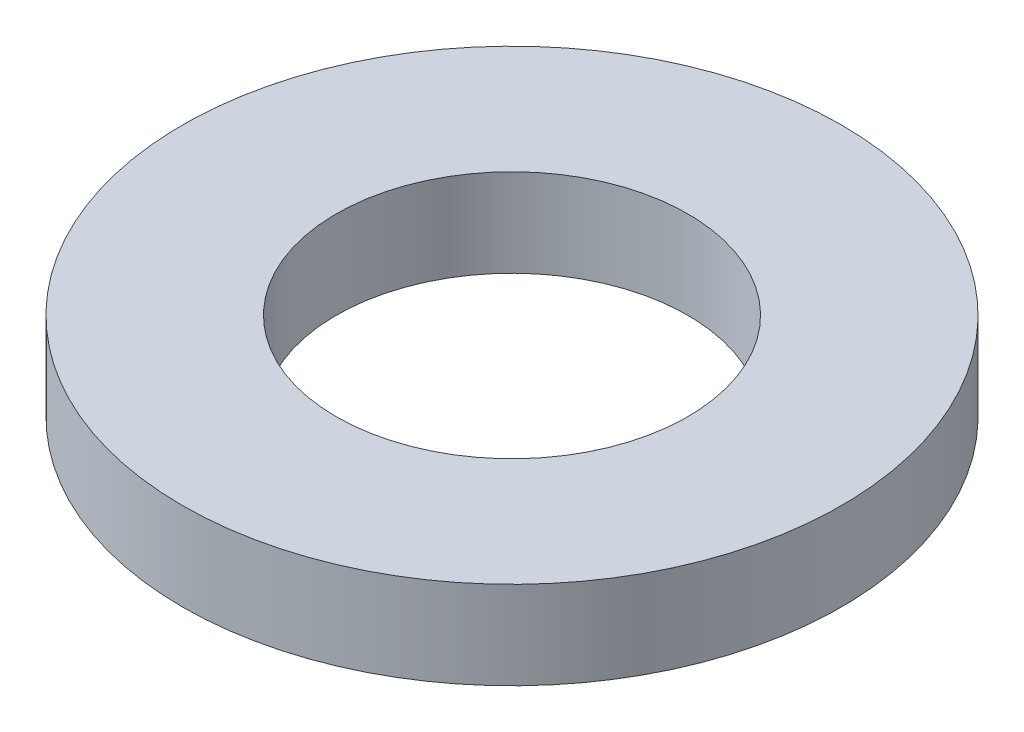
ISO-10303-21;
HEADER;
FILE_DESCRIPTION(('STEP AP214'),'2;1');
FILE_NAME('part.step','',(''),(''),'','','');
FILE_SCHEMA(('AUTOMOTIVE_DESIGN { 1 0 10303 214 1 1 1 1 }'));
ENDSEC;
DATA;
#1=APPLICATION_CONTEXT('core data for automotive mechanical design processes');
#2=APPLICATION_PROTOCOL_DEFINITION('international standard','automotive_design',2000,#1);
#3=PRODUCT_CONTEXT('',#1,'mechanical');
#4=PRODUCT('Part','Part','',(#3));
#5=PRODUCT_RELATED_PRODUCT_CATEGORY('part','',(#4));
#6=PRODUCT_DEFINITION_FORMATION('','',#4);
#7=PRODUCT_DEFINITION_CONTEXT('part definition',#1,'design');
#8=PRODUCT_DEFINITION('design','',#6,#7);
#9=PRODUCT_DEFINITION_SHAPE('','',#8);
#10=(LENGTH_UNIT() NAMED_UNIT(*) SI_UNIT(.MILLI.,.METRE.));
#11=(NAMED_UNIT(*) PLANE_ANGLE_UNIT() SI_UNIT($,.RADIAN.));
#12=(NAMED_UNIT(*) SI_UNIT($,.STERADIAN.) SOLID_ANGLE_UNIT());
#13=UNCERTAINTY_MEASURE_WITH_UNIT(LENGTH_MEASURE(1.E-05),#10,'distance_accuracy_value','');
#14=(GEOMETRIC_REPRESENTATION_CONTEXT(3) GLOBAL_UNCERTAINTY_ASSIGNED_CONTEXT((#13)) GLOBAL_UNIT_ASSIGNED_CONTEXT((#10,
#11,#12)) REPRESENTATION_CONTEXT('',''));
#15=CARTESIAN_POINT('',(0.,0.,0.));
#16=DIRECTION('',(0.,0.,1.));
#17=DIRECTION('',(1.,0.,0.));
#18=AXIS2_PLACEMENT_3D('',#15,#16,#17);
#19=CARTESIAN_POINT('',(0.,2.,0.));
#20=DIRECTION('',(0.,1.,0.));
#21=DIRECTION('',(0.,0.,1.));
#22=AXIS2_PLACEMENT_3D('',#19,#20,#21);
#23=PLANE('',#22);
#24=CARTESIAN_POINT('',(0.,2.,0.));
#25=DIRECTION('',(0.,1.,0.));
#26=DIRECTION('',(0.,0.,1.));
#27=AXIS2_PLACEMENT_3D('',#24,#25,#26);
#28=CIRCLE('',#27,7.5);
#29=CARTESIAN_POINT('',(0.,2.,7.5));
#30=VERTEX_POINT('',#29);
#31=EDGE_CURVE('E10',#30,#30,#28,.T.);
#32=ORIENTED_EDGE('',*,*,#31,.T.);
#33=EDGE_LOOP('',(#32));
#34=FACE_BOUND('',#33,.T.);
#35=CARTESIAN_POINT('',(0.,2.,0.));
#36=DIRECTION('',(0.,1.,0.));
#37=DIRECTION('',(0.,0.,1.));
#38=AXIS2_PLACEMENT_3D('',#35,#36,#37);
#39=CIRCLE('',#38,4.);
#40=CARTESIAN_POINT('',(0.,2.,4.));
#41=VERTEX_POINT('',#40);
#42=EDGE_CURVE('E44',#41,#41,#39,.T.);
#43=ORIENTED_EDGE('',*,*,#42,.F.);
#44=EDGE_LOOP('',(#43));
#45=FACE_BOUND('',#44,.T.);
#46=ADVANCED_FACE('F33',(#34,#45),#23,.T.);
#47=CARTESIAN_POINT('',(0.,0.,0.));
#48=DIRECTION('',(0.,1.,0.));
#49=DIRECTION('',(0.,0.,1.));
#50=AXIS2_PLACEMENT_3D('',#47,#48,#49);
#51=PLANE('',#50);
#52=CARTESIAN_POINT('',(0.,0.,0.));
#53=DIRECTION('',(0.,1.,0.));
#54=DIRECTION('',(0.,0.,1.));
#55=AXIS2_PLACEMENT_3D('',#52,#53,#54);
#56=CIRCLE('',#55,7.5);
#57=CARTESIAN_POINT('',(0.,0.,7.5));
#58=VERTEX_POINT('',#57);
#59=EDGE_CURVE('E37',#58,#58,#56,.T.);
#60=ORIENTED_EDGE('',*,*,#59,.F.);
#61=EDGE_LOOP('',(#60));
#62=FACE_BOUND('',#61,.T.);
#63=CARTESIAN_POINT('',(0.,0.,0.));
#64=DIRECTION('',(0.,1.,0.));
#65=DIRECTION('',(0.,0.,1.));
#66=AXIS2_PLACEMENT_3D('',#63,#64,#65);
#67=CIRCLE('',#66,4.);
#68=CARTESIAN_POINT('',(0.,0.,4.));
#69=VERTEX_POINT('',#68);
#70=EDGE_CURVE('E46',#69,#69,#67,.T.);
#71=ORIENTED_EDGE('',*,*,#70,.T.);
#72=EDGE_LOOP('',(#71));
#73=FACE_BOUND('',#72,.T.);
#74=ADVANCED_FACE('F56',(#62,#73),#51,.F.);
#75=CARTESIAN_POINT('',(0.,2.,0.));
#76=DIRECTION('',(0.,-1.,0.));
#77=DIRECTION('',(0.,0.,-1.));
#78=AXIS2_PLACEMENT_3D('',#75,#76,#77);
#79=CYLINDRICAL_SURFACE('',#78,7.5);
#80=ORIENTED_EDGE('',*,*,#31,.F.);
#81=EDGE_LOOP('',(#80));
#82=FACE_BOUND('',#81,.T.);
#83=ORIENTED_EDGE('',*,*,#59,.T.);
#84=EDGE_LOOP('',(#83));
#85=FACE_BOUND('',#84,.T.);
#86=ADVANCED_FACE('F35',(#82,#85),#79,.T.);
#87=CARTESIAN_POINT('',(0.,2.,0.));
#88=DIRECTION('',(0.,-1.,0.));
#89=DIRECTION('',(0.,0.,-1.));
#90=AXIS2_PLACEMENT_3D('',#87,#88,#89);
#91=CYLINDRICAL_SURFACE('',#90,4.);
#92=ORIENTED_EDGE('',*,*,#42,.T.);
#93=EDGE_LOOP('',(#92));
#94=FACE_BOUND('',#93,.T.);
#95=ORIENTED_EDGE('',*,*,#70,.F.);
#96=EDGE_LOOP('',(#95));
#97=FACE_BOUND('',#96,.T.);
#98=ADVANCED_FACE('F52',(#94,#97),#91,.F.);
#99=CLOSED_SHELL('',(#46,#74,#86,#98));
#100=MANIFOLD_SOLID_BREP('B2',#99);
#101=ADVANCED_BREP_SHAPE_REPRESENTATION('',(#18,#100),#14);
#102=SHAPE_DEFINITION_REPRESENTATION(#9,#101);
ENDSEC;
END-ISO-10303-21;
